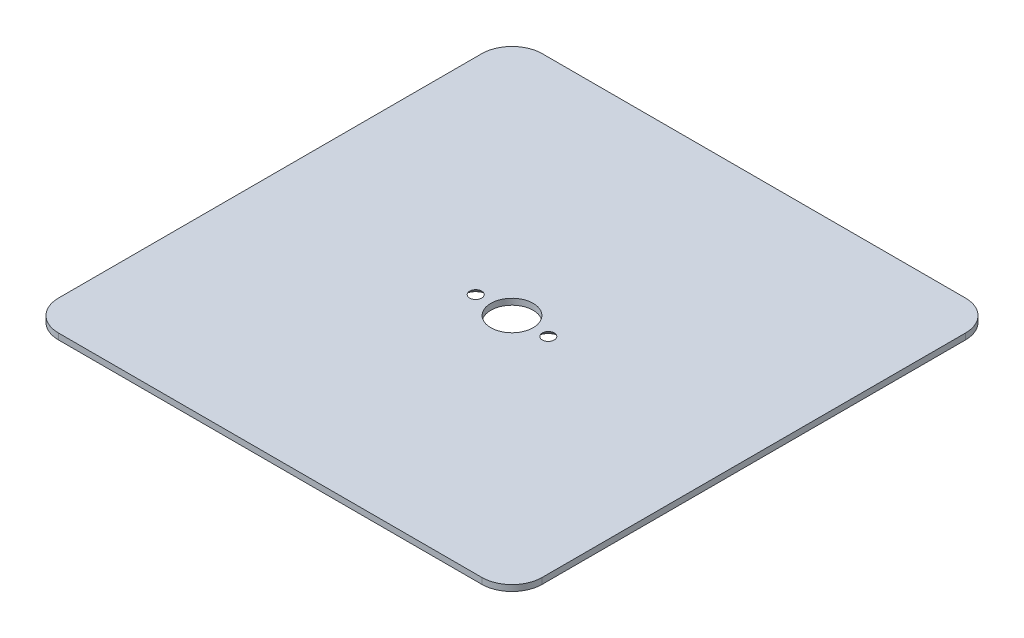
ISO-10303-21;
HEADER;
FILE_DESCRIPTION(('STEP AP214'),'2;1');
FILE_NAME('part.step','',(''),(''),'','','');
FILE_SCHEMA(('AUTOMOTIVE_DESIGN { 1 0 10303 214 1 1 1 1 }'));
ENDSEC;
DATA;
#1=APPLICATION_CONTEXT('core data for automotive mechanical design processes');
#2=APPLICATION_PROTOCOL_DEFINITION('international standard','automotive_design',2000,#1);
#3=PRODUCT_CONTEXT('',#1,'mechanical');
#4=PRODUCT('Part','Part','',(#3));
#5=PRODUCT_RELATED_PRODUCT_CATEGORY('part','',(#4));
#6=PRODUCT_DEFINITION_FORMATION('','',#4);
#7=PRODUCT_DEFINITION_CONTEXT('part definition',#1,'design');
#8=PRODUCT_DEFINITION('design','',#6,#7);
#9=PRODUCT_DEFINITION_SHAPE('','',#8);
#10=(LENGTH_UNIT() NAMED_UNIT(*) SI_UNIT(.MILLI.,.METRE.));
#11=(NAMED_UNIT(*) PLANE_ANGLE_UNIT() SI_UNIT($,.RADIAN.));
#12=(NAMED_UNIT(*) SI_UNIT($,.STERADIAN.) SOLID_ANGLE_UNIT());
#13=UNCERTAINTY_MEASURE_WITH_UNIT(LENGTH_MEASURE(1.E-05),#10,'distance_accuracy_value','');
#14=(GEOMETRIC_REPRESENTATION_CONTEXT(3) GLOBAL_UNCERTAINTY_ASSIGNED_CONTEXT((#13)) GLOBAL_UNIT_ASSIGNED_CONTEXT((#10,
#11,#12)) REPRESENTATION_CONTEXT('',''));
#15=CARTESIAN_POINT('',(0.,0.,0.));
#16=DIRECTION('',(0.,0.,1.));
#17=DIRECTION('',(1.,0.,0.));
#18=AXIS2_PLACEMENT_3D('',#15,#16,#17);
#19=CARTESIAN_POINT('',(0.,1.,0.));
#20=DIRECTION('',(1.,0.,0.));
#21=DIRECTION('',(0.,0.,-1.));
#22=AXIS2_PLACEMENT_3D('',#19,#20,#21);
#23=PLANE('',#22);
#24=DIRECTION('',(0.,0.,1.));
#25=VECTOR('',#24,1.);
#26=CARTESIAN_POINT('',(0.,1.,0.));
#27=LINE('',#26,#25);
#28=CARTESIAN_POINT('',(0.,1.,-75.));
#29=VERTEX_POINT('',#28);
#30=CARTESIAN_POINT('',(0.,1.,-5.));
#31=VERTEX_POINT('',#30);
#32=EDGE_CURVE('E121',#29,#31,#27,.T.);
#33=ORIENTED_EDGE('',*,*,#32,.F.);
#34=DIRECTION('',(0.,-1.,0.));
#35=VECTOR('',#34,1.);
#36=CARTESIAN_POINT('',(0.,1.,-75.));
#37=LINE('',#36,#35);
#38=CARTESIAN_POINT('',(0.,0.,-75.));
#39=VERTEX_POINT('',#38);
#40=EDGE_CURVE('E106',#29,#39,#37,.T.);
#41=ORIENTED_EDGE('',*,*,#40,.T.);
#42=DIRECTION('',(0.,0.,1.));
#43=VECTOR('',#42,1.);
#44=CARTESIAN_POINT('',(0.,0.,0.));
#45=LINE('',#44,#43);
#46=CARTESIAN_POINT('',(0.,0.,-5.));
#47=VERTEX_POINT('',#46);
#48=EDGE_CURVE('E118',#39,#47,#45,.T.);
#49=ORIENTED_EDGE('',*,*,#48,.T.);
#50=DIRECTION('',(0.,-1.,0.));
#51=VECTOR('',#50,1.);
#52=CARTESIAN_POINT('',(0.,1.,-5.));
#53=LINE('',#52,#51);
#54=EDGE_CURVE('E123',#47,#31,#53,.F.);
#55=ORIENTED_EDGE('',*,*,#54,.T.);
#56=EDGE_LOOP('',(#33,#41,#49,#55));
#57=FACE_BOUND('',#56,.T.);
#58=ADVANCED_FACE('F35',(#57),#23,.F.);
#59=CARTESIAN_POINT('',(0.,1.,0.));
#60=DIRECTION('',(0.,0.,-1.));
#61=DIRECTION('',(-1.,0.,0.));
#62=AXIS2_PLACEMENT_3D('',#59,#60,#61);
#63=PLANE('',#62);
#64=DIRECTION('',(1.,0.,0.));
#65=VECTOR('',#64,1.);
#66=CARTESIAN_POINT('',(0.,1.,0.));
#67=LINE('',#66,#65);
#68=CARTESIAN_POINT('',(5.,1.,0.));
#69=VERTEX_POINT('',#68);
#70=CARTESIAN_POINT('',(75.,1.,0.));
#71=VERTEX_POINT('',#70);
#72=EDGE_CURVE('E219',#69,#71,#67,.T.);
#73=ORIENTED_EDGE('',*,*,#72,.F.);
#74=DIRECTION('',(0.,-1.,0.));
#75=VECTOR('',#74,1.);
#76=CARTESIAN_POINT('',(5.,1.,0.));
#77=LINE('',#76,#75);
#78=CARTESIAN_POINT('',(5.,0.,0.));
#79=VERTEX_POINT('',#78);
#80=EDGE_CURVE('E160',#69,#79,#77,.T.);
#81=ORIENTED_EDGE('',*,*,#80,.T.);
#82=DIRECTION('',(1.,0.,0.));
#83=VECTOR('',#82,1.);
#84=CARTESIAN_POINT('',(0.,0.,0.));
#85=LINE('',#84,#83);
#86=CARTESIAN_POINT('',(75.,0.,0.));
#87=VERTEX_POINT('',#86);
#88=EDGE_CURVE('E127',#79,#87,#85,.T.);
#89=ORIENTED_EDGE('',*,*,#88,.T.);
#90=DIRECTION('',(0.,-1.,0.));
#91=VECTOR('',#90,1.);
#92=CARTESIAN_POINT('',(75.,1.,0.));
#93=LINE('',#92,#91);
#94=EDGE_CURVE('E158',#87,#71,#93,.F.);
#95=ORIENTED_EDGE('',*,*,#94,.T.);
#96=EDGE_LOOP('',(#73,#81,#89,#95));
#97=FACE_BOUND('',#96,.T.);
#98=ADVANCED_FACE('F181',(#97),#63,.F.);
#99=CARTESIAN_POINT('',(80.,1.,0.));
#100=DIRECTION('',(-1.,0.,0.));
#101=DIRECTION('',(0.,0.,1.));
#102=AXIS2_PLACEMENT_3D('',#99,#100,#101);
#103=PLANE('',#102);
#104=DIRECTION('',(0.,0.,-1.));
#105=VECTOR('',#104,1.);
#106=CARTESIAN_POINT('',(80.,0.,0.));
#107=LINE('',#106,#105);
#108=CARTESIAN_POINT('',(80.,0.,-5.));
#109=VERTEX_POINT('',#108);
#110=CARTESIAN_POINT('',(80.,0.,-75.));
#111=VERTEX_POINT('',#110);
#112=EDGE_CURVE('E131',#109,#111,#107,.T.);
#113=ORIENTED_EDGE('',*,*,#112,.T.);
#114=DIRECTION('',(0.,-1.,0.));
#115=VECTOR('',#114,1.);
#116=CARTESIAN_POINT('',(80.,1.,-75.));
#117=LINE('',#116,#115);
#118=CARTESIAN_POINT('',(80.,1.,-75.));
#119=VERTEX_POINT('',#118);
#120=EDGE_CURVE('E50',#111,#119,#117,.F.);
#121=ORIENTED_EDGE('',*,*,#120,.T.);
#122=DIRECTION('',(0.,0.,-1.));
#123=VECTOR('',#122,1.);
#124=CARTESIAN_POINT('',(80.,1.,0.));
#125=LINE('',#124,#123);
#126=CARTESIAN_POINT('',(80.,1.,-5.));
#127=VERTEX_POINT('',#126);
#128=EDGE_CURVE('E212',#127,#119,#125,.T.);
#129=ORIENTED_EDGE('',*,*,#128,.F.);
#130=DIRECTION('',(0.,-1.,0.));
#131=VECTOR('',#130,1.);
#132=CARTESIAN_POINT('',(80.,1.,-5.));
#133=LINE('',#132,#131);
#134=EDGE_CURVE('E163',#127,#109,#133,.T.);
#135=ORIENTED_EDGE('',*,*,#134,.T.);
#136=EDGE_LOOP('',(#113,#121,#129,#135));
#137=FACE_BOUND('',#136,.T.);
#138=ADVANCED_FACE('F186',(#137),#103,.F.);
#139=CARTESIAN_POINT('',(0.,1.,-80.));
#140=DIRECTION('',(0.,0.,1.));
#141=DIRECTION('',(1.,0.,0.));
#142=AXIS2_PLACEMENT_3D('',#139,#140,#141);
#143=PLANE('',#142);
#144=DIRECTION('',(-1.,0.,0.));
#145=VECTOR('',#144,1.);
#146=CARTESIAN_POINT('',(0.,0.,-80.));
#147=LINE('',#146,#145);
#148=CARTESIAN_POINT('',(75.,0.,-80.));
#149=VERTEX_POINT('',#148);
#150=CARTESIAN_POINT('',(4.99999999999999,0.,-80.));
#151=VERTEX_POINT('',#150);
#152=EDGE_CURVE('E141',#149,#151,#147,.T.);
#153=ORIENTED_EDGE('',*,*,#152,.T.);
#154=DIRECTION('',(0.,-1.,0.));
#155=VECTOR('',#154,1.);
#156=CARTESIAN_POINT('',(4.99999999999999,1.,-80.));
#157=LINE('',#156,#155);
#158=CARTESIAN_POINT('',(4.99999999999999,1.,-80.));
#159=VERTEX_POINT('',#158);
#160=EDGE_CURVE('E107',#151,#159,#157,.F.);
#161=ORIENTED_EDGE('',*,*,#160,.T.);
#162=DIRECTION('',(-1.,0.,0.));
#163=VECTOR('',#162,1.);
#164=CARTESIAN_POINT('',(0.,1.,-80.));
#165=LINE('',#164,#163);
#166=CARTESIAN_POINT('',(75.,1.,-80.));
#167=VERTEX_POINT('',#166);
#168=EDGE_CURVE('E137',#167,#159,#165,.T.);
#169=ORIENTED_EDGE('',*,*,#168,.F.);
#170=DIRECTION('',(0.,-1.,0.));
#171=VECTOR('',#170,1.);
#172=CARTESIAN_POINT('',(75.,1.,-80.));
#173=LINE('',#172,#171);
#174=EDGE_CURVE('E112',#167,#149,#173,.T.);
#175=ORIENTED_EDGE('',*,*,#174,.T.);
#176=EDGE_LOOP('',(#153,#161,#169,#175));
#177=FACE_BOUND('',#176,.T.);
#178=ADVANCED_FACE('F217',(#177),#143,.F.);
#179=CARTESIAN_POINT('',(0.,1.,-80.));
#180=DIRECTION('',(0.,-1.,0.));
#181=DIRECTION('',(0.,0.,-1.));
#182=AXIS2_PLACEMENT_3D('',#179,#180,#181);
#183=PLANE('',#182);
#184=CARTESIAN_POINT('',(46.,1.,-40.));
#185=DIRECTION('',(0.,1.,0.));
#186=DIRECTION('',(0.,0.,-1.));
#187=AXIS2_PLACEMENT_3D('',#184,#185,#186);
#188=CIRCLE('',#187,0.999999999999998);
#189=CARTESIAN_POINT('',(46.,1.,-41.));
#190=VERTEX_POINT('',#189);
#191=EDGE_CURVE('E228',#190,#190,#188,.T.);
#192=ORIENTED_EDGE('',*,*,#191,.F.);
#193=EDGE_LOOP('',(#192));
#194=FACE_BOUND('',#193,.T.);
#195=CARTESIAN_POINT('',(34.,1.,-40.));
#196=DIRECTION('',(0.,1.,0.));
#197=DIRECTION('',(0.,0.,1.));
#198=AXIS2_PLACEMENT_3D('',#195,#196,#197);
#199=CIRCLE('',#198,0.999999999999998);
#200=CARTESIAN_POINT('',(34.,1.,-39.));
#201=VERTEX_POINT('',#200);
#202=EDGE_CURVE('E224',#201,#201,#199,.T.);
#203=ORIENTED_EDGE('',*,*,#202,.F.);
#204=EDGE_LOOP('',(#203));
#205=FACE_BOUND('',#204,.T.);
#206=CARTESIAN_POINT('',(40.,1.,-40.));
#207=DIRECTION('',(0.,-1.,0.));
#208=DIRECTION('',(0.,0.,-1.));
#209=AXIS2_PLACEMENT_3D('',#206,#207,#208);
#210=CIRCLE('',#209,3.5);
#211=CARTESIAN_POINT('',(40.,1.,-43.5));
#212=VERTEX_POINT('',#211);
#213=EDGE_CURVE('E128',#212,#212,#210,.T.);
#214=ORIENTED_EDGE('',*,*,#213,.T.);
#215=EDGE_LOOP('',(#214));
#216=FACE_BOUND('',#215,.T.);
#217=ORIENTED_EDGE('',*,*,#168,.T.);
#218=CARTESIAN_POINT('',(4.99999999999999,1.,-75.));
#219=DIRECTION('',(0.,-1.,0.));
#220=DIRECTION('',(0.,0.,-1.));
#221=AXIS2_PLACEMENT_3D('',#218,#219,#220);
#222=CIRCLE('',#221,5.);
#223=EDGE_CURVE('E156',#159,#29,#222,.F.);
#224=ORIENTED_EDGE('',*,*,#223,.T.);
#225=ORIENTED_EDGE('',*,*,#32,.T.);
#226=CARTESIAN_POINT('',(5.,1.,-5.));
#227=DIRECTION('',(0.,-1.,0.));
#228=DIRECTION('',(0.,0.,-1.));
#229=AXIS2_PLACEMENT_3D('',#226,#227,#228);
#230=CIRCLE('',#229,5.);
#231=EDGE_CURVE('E154',#31,#69,#230,.F.);
#232=ORIENTED_EDGE('',*,*,#231,.T.);
#233=ORIENTED_EDGE('',*,*,#72,.T.);
#234=CARTESIAN_POINT('',(75.,1.,-5.));
#235=DIRECTION('',(0.,-1.,0.));
#236=DIRECTION('',(0.,0.,-1.));
#237=AXIS2_PLACEMENT_3D('',#234,#235,#236);
#238=CIRCLE('',#237,5.);
#239=EDGE_CURVE('E57',#71,#127,#238,.F.);
#240=ORIENTED_EDGE('',*,*,#239,.T.);
#241=ORIENTED_EDGE('',*,*,#128,.T.);
#242=CARTESIAN_POINT('',(75.,1.,-75.));
#243=DIRECTION('',(0.,-1.,0.));
#244=DIRECTION('',(0.,0.,-1.));
#245=AXIS2_PLACEMENT_3D('',#242,#243,#244);
#246=CIRCLE('',#245,5.);
#247=EDGE_CURVE('E152',#119,#167,#246,.F.);
#248=ORIENTED_EDGE('',*,*,#247,.T.);
#249=EDGE_LOOP('',(#217,#224,#225,#232,#233,#240,#241,#248));
#250=FACE_BOUND('',#249,.T.);
#251=ADVANCED_FACE('F231',(#194,#205,#216,#250),#183,.F.);
#252=CARTESIAN_POINT('',(0.,0.,-80.));
#253=DIRECTION('',(0.,-1.,0.));
#254=DIRECTION('',(0.,0.,-1.));
#255=AXIS2_PLACEMENT_3D('',#252,#253,#254);
#256=PLANE('',#255);
#257=CARTESIAN_POINT('',(34.,0.,-40.));
#258=DIRECTION('',(0.,-1.,0.));
#259=DIRECTION('',(0.,0.,-1.));
#260=AXIS2_PLACEMENT_3D('',#257,#258,#259);
#261=CIRCLE('',#260,2.);
#262=CARTESIAN_POINT('',(34.,0.,-42.));
#263=VERTEX_POINT('',#262);
#264=EDGE_CURVE('E11',#263,#263,#261,.F.);
#265=ORIENTED_EDGE('',*,*,#264,.T.);
#266=EDGE_LOOP('',(#265));
#267=FACE_BOUND('',#266,.T.);
#268=CARTESIAN_POINT('',(46.,0.,-40.));
#269=DIRECTION('',(0.,-1.,0.));
#270=DIRECTION('',(0.,0.,-1.));
#271=AXIS2_PLACEMENT_3D('',#268,#269,#270);
#272=CIRCLE('',#271,2.);
#273=CARTESIAN_POINT('',(46.,0.,-42.));
#274=VERTEX_POINT('',#273);
#275=EDGE_CURVE('E43',#274,#274,#272,.F.);
#276=ORIENTED_EDGE('',*,*,#275,.T.);
#277=EDGE_LOOP('',(#276));
#278=FACE_BOUND('',#277,.T.);
#279=CARTESIAN_POINT('',(40.,0.,-40.));
#280=DIRECTION('',(0.,-1.,0.));
#281=DIRECTION('',(0.,0.,-1.));
#282=AXIS2_PLACEMENT_3D('',#279,#280,#281);
#283=CIRCLE('',#282,3.5);
#284=CARTESIAN_POINT('',(40.,0.,-43.5));
#285=VERTEX_POINT('',#284);
#286=EDGE_CURVE('E134',#285,#285,#283,.T.);
#287=ORIENTED_EDGE('',*,*,#286,.F.);
#288=EDGE_LOOP('',(#287));
#289=FACE_BOUND('',#288,.T.);
#290=ORIENTED_EDGE('',*,*,#48,.F.);
#291=CARTESIAN_POINT('',(4.99999999999999,0.,-75.));
#292=DIRECTION('',(0.,-1.,0.));
#293=DIRECTION('',(0.,0.,-1.));
#294=AXIS2_PLACEMENT_3D('',#291,#292,#293);
#295=CIRCLE('',#294,5.);
#296=EDGE_CURVE('E102',#39,#151,#295,.T.);
#297=ORIENTED_EDGE('',*,*,#296,.T.);
#298=ORIENTED_EDGE('',*,*,#152,.F.);
#299=CARTESIAN_POINT('',(75.,0.,-75.));
#300=DIRECTION('',(0.,-1.,0.));
#301=DIRECTION('',(0.,0.,-1.));
#302=AXIS2_PLACEMENT_3D('',#299,#300,#301);
#303=CIRCLE('',#302,5.);
#304=EDGE_CURVE('E145',#149,#111,#303,.T.);
#305=ORIENTED_EDGE('',*,*,#304,.T.);
#306=ORIENTED_EDGE('',*,*,#112,.F.);
#307=CARTESIAN_POINT('',(75.,0.,-5.));
#308=DIRECTION('',(0.,-1.,0.));
#309=DIRECTION('',(0.,0.,-1.));
#310=AXIS2_PLACEMENT_3D('',#307,#308,#309);
#311=CIRCLE('',#310,5.);
#312=EDGE_CURVE('E122',#109,#87,#311,.T.);
#313=ORIENTED_EDGE('',*,*,#312,.T.);
#314=ORIENTED_EDGE('',*,*,#88,.F.);
#315=CARTESIAN_POINT('',(5.,0.,-5.));
#316=DIRECTION('',(0.,-1.,0.));
#317=DIRECTION('',(0.,0.,-1.));
#318=AXIS2_PLACEMENT_3D('',#315,#316,#317);
#319=CIRCLE('',#318,5.);
#320=EDGE_CURVE('E113',#79,#47,#319,.T.);
#321=ORIENTED_EDGE('',*,*,#320,.T.);
#322=EDGE_LOOP('',(#290,#297,#298,#305,#306,#313,#314,#321));
#323=FACE_BOUND('',#322,.T.);
#324=ADVANCED_FACE('F125',(#267,#278,#289,#323),#256,.T.);
#325=CARTESIAN_POINT('',(4.99999999999999,1.,-75.));
#326=DIRECTION('',(0.,-1.,0.));
#327=DIRECTION('',(0.,0.,-1.));
#328=AXIS2_PLACEMENT_3D('',#325,#326,#327);
#329=CYLINDRICAL_SURFACE('',#328,5.);
#330=ORIENTED_EDGE('',*,*,#223,.F.);
#331=ORIENTED_EDGE('',*,*,#160,.F.);
#332=ORIENTED_EDGE('',*,*,#296,.F.);
#333=ORIENTED_EDGE('',*,*,#40,.F.);
#334=EDGE_LOOP('',(#330,#331,#332,#333));
#335=FACE_BOUND('',#334,.T.);
#336=ADVANCED_FACE('F105',(#335),#329,.T.);
#337=CARTESIAN_POINT('',(5.,1.,-5.));
#338=DIRECTION('',(0.,-1.,0.));
#339=DIRECTION('',(0.,0.,-1.));
#340=AXIS2_PLACEMENT_3D('',#337,#338,#339);
#341=CYLINDRICAL_SURFACE('',#340,5.);
#342=ORIENTED_EDGE('',*,*,#231,.F.);
#343=ORIENTED_EDGE('',*,*,#54,.F.);
#344=ORIENTED_EDGE('',*,*,#320,.F.);
#345=ORIENTED_EDGE('',*,*,#80,.F.);
#346=EDGE_LOOP('',(#342,#343,#344,#345));
#347=FACE_BOUND('',#346,.T.);
#348=ADVANCED_FACE('F193',(#347),#341,.T.);
#349=CARTESIAN_POINT('',(75.,1.,-75.));
#350=DIRECTION('',(0.,-1.,0.));
#351=DIRECTION('',(0.,0.,-1.));
#352=AXIS2_PLACEMENT_3D('',#349,#350,#351);
#353=CYLINDRICAL_SURFACE('',#352,5.);
#354=ORIENTED_EDGE('',*,*,#247,.F.);
#355=ORIENTED_EDGE('',*,*,#120,.F.);
#356=ORIENTED_EDGE('',*,*,#304,.F.);
#357=ORIENTED_EDGE('',*,*,#174,.F.);
#358=EDGE_LOOP('',(#354,#355,#356,#357));
#359=FACE_BOUND('',#358,.T.);
#360=ADVANCED_FACE('F196',(#359),#353,.T.);
#361=CARTESIAN_POINT('',(75.,1.,-5.));
#362=DIRECTION('',(0.,-1.,0.));
#363=DIRECTION('',(0.,0.,-1.));
#364=AXIS2_PLACEMENT_3D('',#361,#362,#363);
#365=CYLINDRICAL_SURFACE('',#364,5.);
#366=ORIENTED_EDGE('',*,*,#239,.F.);
#367=ORIENTED_EDGE('',*,*,#94,.F.);
#368=ORIENTED_EDGE('',*,*,#312,.F.);
#369=ORIENTED_EDGE('',*,*,#134,.F.);
#370=EDGE_LOOP('',(#366,#367,#368,#369));
#371=FACE_BOUND('',#370,.T.);
#372=ADVANCED_FACE('F200',(#371),#365,.T.);
#373=CARTESIAN_POINT('',(40.,1.,-40.));
#374=DIRECTION('',(0.,-1.,0.));
#375=DIRECTION('',(0.,0.,-1.));
#376=AXIS2_PLACEMENT_3D('',#373,#374,#375);
#377=CYLINDRICAL_SURFACE('',#376,3.5);
#378=ORIENTED_EDGE('',*,*,#213,.F.);
#379=EDGE_LOOP('',(#378));
#380=FACE_BOUND('',#379,.T.);
#381=ORIENTED_EDGE('',*,*,#286,.T.);
#382=EDGE_LOOP('',(#381));
#383=FACE_BOUND('',#382,.T.);
#384=ADVANCED_FACE('F177',(#380,#383),#377,.F.);
#385=CARTESIAN_POINT('',(34.,0.,-40.));
#386=DIRECTION('',(0.,-1.,0.));
#387=DIRECTION('',(0.,0.,-1.));
#388=AXIS2_PLACEMENT_3D('',#385,#386,#387);
#389=CONICAL_SURFACE('',#388,2.,0.78539816339744);
#390=ORIENTED_EDGE('',*,*,#202,.T.);
#391=EDGE_LOOP('',(#390));
#392=FACE_BOUND('',#391,.T.);
#393=ORIENTED_EDGE('',*,*,#264,.F.);
#394=EDGE_LOOP('',(#393));
#395=FACE_BOUND('',#394,.T.);
#396=ADVANCED_FACE('F172',(#392,#395),#389,.F.);
#397=CARTESIAN_POINT('',(46.,0.,-40.));
#398=DIRECTION('',(0.,-1.,0.));
#399=DIRECTION('',(0.,0.,-1.));
#400=AXIS2_PLACEMENT_3D('',#397,#398,#399);
#401=CONICAL_SURFACE('',#400,2.,0.78539816339744);
#402=ORIENTED_EDGE('',*,*,#191,.T.);
#403=EDGE_LOOP('',(#402));
#404=FACE_BOUND('',#403,.T.);
#405=ORIENTED_EDGE('',*,*,#275,.F.);
#406=EDGE_LOOP('',(#405));
#407=FACE_BOUND('',#406,.T.);
#408=ADVANCED_FACE('F37',(#404,#407),#401,.F.);
#409=CLOSED_SHELL('',(#58,#98,#138,#178,#251,#324,#336,#348,#360,#372,#384,#396,#408));
#410=MANIFOLD_SOLID_BREP('B2',#409);
#411=ADVANCED_BREP_SHAPE_REPRESENTATION('',(#18,#410),#14);
#412=SHAPE_DEFINITION_REPRESENTATION(#9,#411);
ENDSEC;
END-ISO-10303-21;
